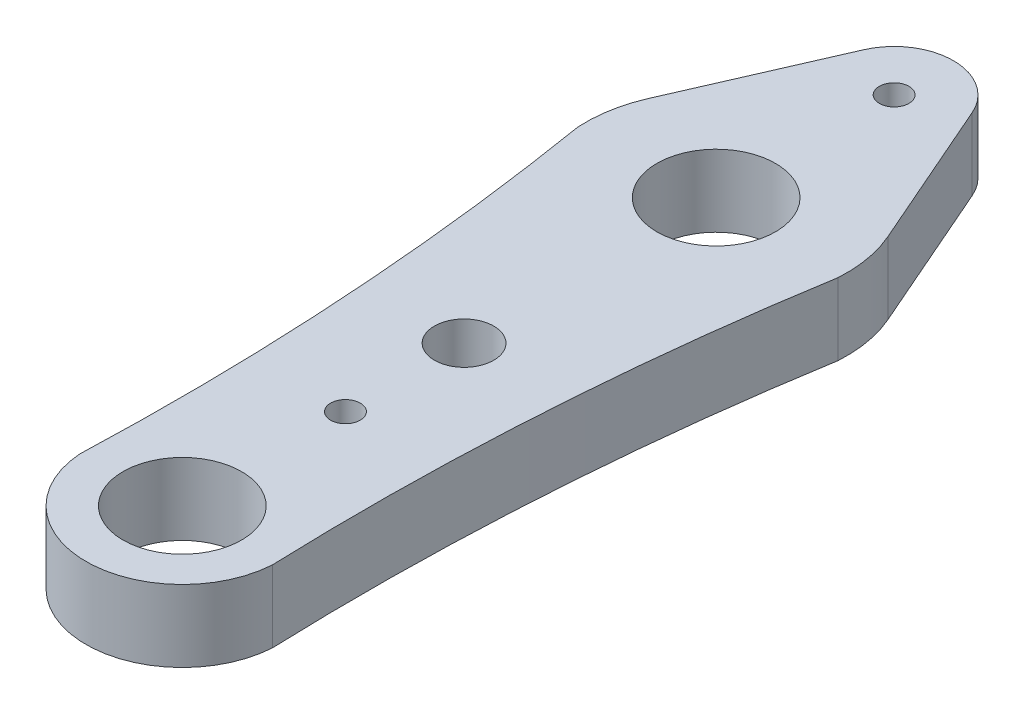
ISO-10303-21;
HEADER;
FILE_DESCRIPTION(('STEP AP214'),'2;1');
FILE_NAME('part.step','',(''),(''),'','','');
FILE_SCHEMA(('AUTOMOTIVE_DESIGN { 1 0 10303 214 1 1 1 1 }'));
ENDSEC;
DATA;
#1=APPLICATION_CONTEXT('core data for automotive mechanical design processes');
#2=APPLICATION_PROTOCOL_DEFINITION('international standard','automotive_design',2000,#1);
#3=PRODUCT_CONTEXT('',#1,'mechanical');
#4=PRODUCT('Part','Part','',(#3));
#5=PRODUCT_RELATED_PRODUCT_CATEGORY('part','',(#4));
#6=PRODUCT_DEFINITION_FORMATION('','',#4);
#7=PRODUCT_DEFINITION_CONTEXT('part definition',#1,'design');
#8=PRODUCT_DEFINITION('design','',#6,#7);
#9=PRODUCT_DEFINITION_SHAPE('','',#8);
#10=(LENGTH_UNIT() NAMED_UNIT(*) SI_UNIT(.MILLI.,.METRE.));
#11=(NAMED_UNIT(*) PLANE_ANGLE_UNIT() SI_UNIT($,.RADIAN.));
#12=(NAMED_UNIT(*) SI_UNIT($,.STERADIAN.) SOLID_ANGLE_UNIT());
#13=UNCERTAINTY_MEASURE_WITH_UNIT(LENGTH_MEASURE(1.E-05),#10,'distance_accuracy_value','');
#14=(GEOMETRIC_REPRESENTATION_CONTEXT(3) GLOBAL_UNCERTAINTY_ASSIGNED_CONTEXT((#13)) GLOBAL_UNIT_ASSIGNED_CONTEXT((#10,
#11,#12)) REPRESENTATION_CONTEXT('',''));
#15=CARTESIAN_POINT('',(0.,0.,0.));
#16=DIRECTION('',(0.,0.,1.));
#17=DIRECTION('',(1.,0.,0.));
#18=AXIS2_PLACEMENT_3D('',#15,#16,#17);
#19=CARTESIAN_POINT('',(14.2976361682622,4.85,-6.24000000000001));
#20=DIRECTION('',(0.916515138991168,0.,-0.4));
#21=DIRECTION('',(-0.4,0.,-0.916515138991168));
#22=AXIS2_PLACEMENT_3D('',#19,#20,#21);
#23=PLANE('',#22);
#24=DIRECTION('',(0.400000000000001,0.,0.916515138991168));
#25=VECTOR('',#24,1.);
#26=CARTESIAN_POINT('',(14.2976361682622,0.,-6.24000000000001));
#27=LINE('',#26,#25);
#28=CARTESIAN_POINT('',(3.66606055596467,0.,-30.6));
#29=VERTEX_POINT('',#28);
#30=CARTESIAN_POINT('',(8.06533322312229,0.,-20.52));
#31=VERTEX_POINT('',#30);
#32=EDGE_CURVE('E164',#29,#31,#27,.T.);
#33=ORIENTED_EDGE('',*,*,#32,.F.);
#34=DIRECTION('',(0.,-1.,0.));
#35=VECTOR('',#34,1.);
#36=CARTESIAN_POINT('',(3.66606055596467,4.85,-30.6));
#37=LINE('',#36,#35);
#38=CARTESIAN_POINT('',(3.66606055596467,4.85,-30.6));
#39=VERTEX_POINT('',#38);
#40=EDGE_CURVE('E11',#39,#29,#37,.T.);
#41=ORIENTED_EDGE('',*,*,#40,.F.);
#42=DIRECTION('',(0.400000000000001,0.,0.916515138991168));
#43=VECTOR('',#42,1.);
#44=CARTESIAN_POINT('',(14.2976361682622,4.85,-6.24000000000001));
#45=LINE('',#44,#43);
#46=CARTESIAN_POINT('',(8.06533322312229,4.85,-20.52));
#47=VERTEX_POINT('',#46);
#48=EDGE_CURVE('E230',#39,#47,#45,.T.);
#49=ORIENTED_EDGE('',*,*,#48,.T.);
#50=DIRECTION('',(0.,-1.,0.));
#51=VECTOR('',#50,1.);
#52=CARTESIAN_POINT('',(8.06533322312229,4.85,-20.52));
#53=LINE('',#52,#51);
#54=EDGE_CURVE('E97',#47,#31,#53,.T.);
#55=ORIENTED_EDGE('',*,*,#54,.T.);
#56=EDGE_LOOP('',(#33,#41,#49,#55));
#57=FACE_BOUND('',#56,.T.);
#58=ADVANCED_FACE('F45',(#57),#23,.T.);
#59=CARTESIAN_POINT('',(0.,4.85,-29.));
#60=DIRECTION('',(0.,-1.,0.));
#61=DIRECTION('',(0.,0.,-1.));
#62=AXIS2_PLACEMENT_3D('',#59,#60,#61);
#63=CYLINDRICAL_SURFACE('',#62,4.);
#64=CARTESIAN_POINT('',(0.,0.,-29.));
#65=DIRECTION('',(0.,1.,0.));
#66=DIRECTION('',(0.,0.,1.));
#67=AXIS2_PLACEMENT_3D('',#64,#65,#66);
#68=CIRCLE('',#67,4.);
#69=CARTESIAN_POINT('',(-3.66606055596467,0.,-30.6));
#70=VERTEX_POINT('',#69);
#71=EDGE_CURVE('E168',#29,#70,#68,.T.);
#72=ORIENTED_EDGE('',*,*,#71,.T.);
#73=DIRECTION('',(0.,-1.,0.));
#74=VECTOR('',#73,1.);
#75=CARTESIAN_POINT('',(-3.66606055596467,4.85,-30.6));
#76=LINE('',#75,#74);
#77=CARTESIAN_POINT('',(-3.66606055596467,4.85,-30.6));
#78=VERTEX_POINT('',#77);
#79=EDGE_CURVE('E55',#78,#70,#76,.T.);
#80=ORIENTED_EDGE('',*,*,#79,.F.);
#81=CARTESIAN_POINT('',(0.,4.85,-29.));
#82=DIRECTION('',(0.,1.,0.));
#83=DIRECTION('',(0.,0.,1.));
#84=AXIS2_PLACEMENT_3D('',#81,#82,#83);
#85=CIRCLE('',#84,4.);
#86=EDGE_CURVE('E226',#39,#78,#85,.T.);
#87=ORIENTED_EDGE('',*,*,#86,.F.);
#88=ORIENTED_EDGE('',*,*,#40,.T.);
#89=EDGE_LOOP('',(#72,#80,#87,#88));
#90=FACE_BOUND('',#89,.T.);
#91=ADVANCED_FACE('F215',(#90),#63,.T.);
#92=CARTESIAN_POINT('',(-14.2976361682622,4.85,-6.24));
#93=DIRECTION('',(-0.916515138991168,0.,-0.4));
#94=DIRECTION('',(-0.4,0.,0.916515138991168));
#95=AXIS2_PLACEMENT_3D('',#92,#93,#94);
#96=PLANE('',#95);
#97=DIRECTION('',(0.4,0.,-0.916515138991168));
#98=VECTOR('',#97,1.);
#99=CARTESIAN_POINT('',(-14.2976361682622,0.,-6.24));
#100=LINE('',#99,#98);
#101=CARTESIAN_POINT('',(-8.06533322312228,0.,-20.52));
#102=VERTEX_POINT('',#101);
#103=EDGE_CURVE('E172',#102,#70,#100,.T.);
#104=ORIENTED_EDGE('',*,*,#103,.F.);
#105=DIRECTION('',(0.,-1.,0.));
#106=VECTOR('',#105,1.);
#107=CARTESIAN_POINT('',(-8.06533322312228,4.85,-20.52));
#108=LINE('',#107,#106);
#109=CARTESIAN_POINT('',(-8.06533322312228,4.85,-20.52));
#110=VERTEX_POINT('',#109);
#111=EDGE_CURVE('E203',#110,#102,#108,.T.);
#112=ORIENTED_EDGE('',*,*,#111,.F.);
#113=DIRECTION('',(0.4,0.,-0.916515138991168));
#114=VECTOR('',#113,1.);
#115=CARTESIAN_POINT('',(-14.2976361682622,4.85,-6.24));
#116=LINE('',#115,#114);
#117=EDGE_CURVE('E212',#110,#78,#116,.T.);
#118=ORIENTED_EDGE('',*,*,#117,.T.);
#119=ORIENTED_EDGE('',*,*,#79,.T.);
#120=EDGE_LOOP('',(#104,#112,#118,#119));
#121=FACE_BOUND('',#120,.T.);
#122=ADVANCED_FACE('F210',(#121),#96,.T.);
#123=CARTESIAN_POINT('',(0.,4.85,-17.));
#124=DIRECTION('',(0.,-1.,0.));
#125=DIRECTION('',(0.,0.,-1.));
#126=AXIS2_PLACEMENT_3D('',#123,#124,#125);
#127=CYLINDRICAL_SURFACE('',#126,8.79999999999994);
#128=CARTESIAN_POINT('',(0.,0.,-17.));
#129=DIRECTION('',(0.,1.,0.));
#130=DIRECTION('',(0.,0.,1.));
#131=AXIS2_PLACEMENT_3D('',#128,#129,#130);
#132=CIRCLE('',#131,8.79999999999994);
#133=CARTESIAN_POINT('',(-8.78202175884568,0.,-16.4377777777778));
#134=VERTEX_POINT('',#133);
#135=EDGE_CURVE('E176',#102,#134,#132,.T.);
#136=ORIENTED_EDGE('',*,*,#135,.T.);
#137=DIRECTION('',(0.,-1.,0.));
#138=VECTOR('',#137,1.);
#139=CARTESIAN_POINT('',(-8.78202175884568,4.85,-16.4377777777778));
#140=LINE('',#139,#138);
#141=CARTESIAN_POINT('',(-8.78202175884568,4.85,-16.4377777777778));
#142=VERTEX_POINT('',#141);
#143=EDGE_CURVE('E199',#142,#134,#140,.T.);
#144=ORIENTED_EDGE('',*,*,#143,.F.);
#145=CARTESIAN_POINT('',(0.,4.85,-17.));
#146=DIRECTION('',(0.,1.,0.));
#147=DIRECTION('',(0.,0.,1.));
#148=AXIS2_PLACEMENT_3D('',#145,#146,#147);
#149=CIRCLE('',#148,8.79999999999994);
#150=EDGE_CURVE('E223',#110,#142,#149,.T.);
#151=ORIENTED_EDGE('',*,*,#150,.F.);
#152=ORIENTED_EDGE('',*,*,#111,.T.);
#153=EDGE_LOOP('',(#136,#144,#151,#152));
#154=FACE_BOUND('',#153,.T.);
#155=ADVANCED_FACE('F221',(#154),#127,.T.);
#156=CARTESIAN_POINT('',(-186.369900957167,4.85,12.9313414096022));
#157=DIRECTION('',(0.,-1.,0.));
#158=DIRECTION('',(0.,0.,-1.));
#159=AXIS2_PLACEMENT_3D('',#156,#157,#158);
#160=CYLINDRICAL_SURFACE('',#159,180.);
#161=CARTESIAN_POINT('',(-186.369900957167,0.,12.9313414096022));
#162=DIRECTION('',(0.,1.,0.));
#163=DIRECTION('',(0.,0.,1.));
#164=AXIS2_PLACEMENT_3D('',#161,#162,#163);
#165=CIRCLE('',#164,180.);
#166=CARTESIAN_POINT('',(-6.48672061733083,0.,19.4152777777413));
#167=VERTEX_POINT('',#166);
#168=EDGE_CURVE('E180',#134,#167,#165,.F.);
#169=ORIENTED_EDGE('',*,*,#168,.T.);
#170=DIRECTION('',(0.,-1.,0.));
#171=VECTOR('',#170,1.);
#172=CARTESIAN_POINT('',(-6.48672061733083,4.85,19.4152777777413));
#173=LINE('',#172,#171);
#174=CARTESIAN_POINT('',(-6.48672061733083,4.85,19.4152777777413));
#175=VERTEX_POINT('',#174);
#176=EDGE_CURVE('E135',#175,#167,#173,.T.);
#177=ORIENTED_EDGE('',*,*,#176,.F.);
#178=CARTESIAN_POINT('',(-186.369900957167,4.85,12.9313414096022));
#179=DIRECTION('',(0.,1.,0.));
#180=DIRECTION('',(0.,0.,1.));
#181=AXIS2_PLACEMENT_3D('',#178,#179,#180);
#182=CIRCLE('',#181,180.);
#183=EDGE_CURVE('E121',#142,#175,#182,.F.);
#184=ORIENTED_EDGE('',*,*,#183,.F.);
#185=ORIENTED_EDGE('',*,*,#143,.T.);
#186=EDGE_LOOP('',(#169,#177,#184,#185));
#187=FACE_BOUND('',#186,.T.);
#188=ADVANCED_FACE('F322',(#187),#160,.F.);
#189=CARTESIAN_POINT('',(0.,4.85,19.));
#190=DIRECTION('',(0.,-1.,0.));
#191=DIRECTION('',(0.,0.,-1.));
#192=AXIS2_PLACEMENT_3D('',#189,#190,#191);
#193=CYLINDRICAL_SURFACE('',#192,6.49999999999929);
#194=CARTESIAN_POINT('',(0.,0.,19.));
#195=DIRECTION('',(0.,1.,0.));
#196=DIRECTION('',(0.,0.,1.));
#197=AXIS2_PLACEMENT_3D('',#194,#195,#196);
#198=CIRCLE('',#197,6.49999999999929);
#199=CARTESIAN_POINT('',(6.48672061732839,0.,19.4152777777797));
#200=VERTEX_POINT('',#199);
#201=EDGE_CURVE('E130',#167,#200,#198,.T.);
#202=ORIENTED_EDGE('',*,*,#201,.T.);
#203=DIRECTION('',(0.,-1.,0.));
#204=VECTOR('',#203,1.);
#205=CARTESIAN_POINT('',(6.48672061732839,4.85,19.4152777777797));
#206=LINE('',#205,#204);
#207=CARTESIAN_POINT('',(6.48672061732839,4.85,19.4152777777797));
#208=VERTEX_POINT('',#207);
#209=EDGE_CURVE('E128',#208,#200,#206,.T.);
#210=ORIENTED_EDGE('',*,*,#209,.F.);
#211=CARTESIAN_POINT('',(0.,4.85,19.));
#212=DIRECTION('',(0.,1.,0.));
#213=DIRECTION('',(0.,0.,1.));
#214=AXIS2_PLACEMENT_3D('',#211,#212,#213);
#215=CIRCLE('',#214,6.49999999999929);
#216=EDGE_CURVE('E115',#175,#208,#215,.T.);
#217=ORIENTED_EDGE('',*,*,#216,.F.);
#218=ORIENTED_EDGE('',*,*,#176,.T.);
#219=EDGE_LOOP('',(#202,#210,#217,#218));
#220=FACE_BOUND('',#219,.T.);
#221=ADVANCED_FACE('F129',(#220),#193,.T.);
#222=CARTESIAN_POINT('',(186.369900957163,4.85,12.9313414096301));
#223=DIRECTION('',(0.,-1.,0.));
#224=DIRECTION('',(0.,0.,-1.));
#225=AXIS2_PLACEMENT_3D('',#222,#223,#224);
#226=CYLINDRICAL_SURFACE('',#225,179.999999999999);
#227=CARTESIAN_POINT('',(186.369900957163,0.,12.9313414096301));
#228=DIRECTION('',(0.,1.,0.));
#229=DIRECTION('',(0.,0.,1.));
#230=AXIS2_PLACEMENT_3D('',#227,#228,#229);
#231=CIRCLE('',#230,179.999999999999);
#232=CARTESIAN_POINT('',(8.7820217588446,0.,-16.4377777777603));
#233=VERTEX_POINT('',#232);
#234=EDGE_CURVE('E186',#233,#200,#231,.T.);
#235=ORIENTED_EDGE('',*,*,#234,.F.);
#236=DIRECTION('',(0.,-1.,0.));
#237=VECTOR('',#236,1.);
#238=CARTESIAN_POINT('',(8.7820217588446,4.85,-16.4377777777603));
#239=LINE('',#238,#237);
#240=CARTESIAN_POINT('',(8.7820217588446,4.85,-16.4377777777603));
#241=VERTEX_POINT('',#240);
#242=EDGE_CURVE('E90',#241,#233,#239,.T.);
#243=ORIENTED_EDGE('',*,*,#242,.F.);
#244=CARTESIAN_POINT('',(186.369900957163,4.85,12.9313414096301));
#245=DIRECTION('',(0.,1.,0.));
#246=DIRECTION('',(0.,0.,1.));
#247=AXIS2_PLACEMENT_3D('',#244,#245,#246);
#248=CIRCLE('',#247,179.999999999999);
#249=EDGE_CURVE('E119',#241,#208,#248,.T.);
#250=ORIENTED_EDGE('',*,*,#249,.T.);
#251=ORIENTED_EDGE('',*,*,#209,.T.);
#252=EDGE_LOOP('',(#235,#243,#250,#251));
#253=FACE_BOUND('',#252,.T.);
#254=ADVANCED_FACE('F137',(#253),#226,.F.);
#255=CARTESIAN_POINT('',(0.,4.85,-29.));
#256=DIRECTION('',(0.,-1.,0.));
#257=DIRECTION('',(0.,0.,-1.));
#258=AXIS2_PLACEMENT_3D('',#255,#256,#257);
#259=CYLINDRICAL_SURFACE('',#258,1.);
#260=CARTESIAN_POINT('',(0.,4.85,-29.));
#261=DIRECTION('',(0.,1.,0.));
#262=DIRECTION('',(0.,0.,1.));
#263=AXIS2_PLACEMENT_3D('',#260,#261,#262);
#264=CIRCLE('',#263,1.);
#265=CARTESIAN_POINT('',(0.,4.85,-28.));
#266=VERTEX_POINT('',#265);
#267=EDGE_CURVE('E236',#266,#266,#264,.T.);
#268=ORIENTED_EDGE('',*,*,#267,.T.);
#269=EDGE_LOOP('',(#268));
#270=FACE_BOUND('',#269,.T.);
#271=CARTESIAN_POINT('',(0.,0.,-29.));
#272=DIRECTION('',(0.,1.,0.));
#273=DIRECTION('',(0.,0.,1.));
#274=AXIS2_PLACEMENT_3D('',#271,#272,#273);
#275=CIRCLE('',#274,1.);
#276=CARTESIAN_POINT('',(0.,0.,-28.));
#277=VERTEX_POINT('',#276);
#278=EDGE_CURVE('E160',#277,#277,#275,.T.);
#279=ORIENTED_EDGE('',*,*,#278,.F.);
#280=EDGE_LOOP('',(#279));
#281=FACE_BOUND('',#280,.T.);
#282=ADVANCED_FACE('F270',(#270,#281),#259,.F.);
#283=CARTESIAN_POINT('',(0.,4.85,19.));
#284=DIRECTION('',(0.,-1.,0.));
#285=DIRECTION('',(0.,0.,-1.));
#286=AXIS2_PLACEMENT_3D('',#283,#284,#285);
#287=CYLINDRICAL_SURFACE('',#286,4.);
#288=CARTESIAN_POINT('',(0.,4.85,19.));
#289=DIRECTION('',(0.,1.,0.));
#290=DIRECTION('',(0.,0.,1.));
#291=AXIS2_PLACEMENT_3D('',#288,#289,#290);
#292=CIRCLE('',#291,4.);
#293=CARTESIAN_POINT('',(0.,4.85,23.));
#294=VERTEX_POINT('',#293);
#295=EDGE_CURVE('E240',#294,#294,#292,.T.);
#296=ORIENTED_EDGE('',*,*,#295,.T.);
#297=EDGE_LOOP('',(#296));
#298=FACE_BOUND('',#297,.T.);
#299=CARTESIAN_POINT('',(0.,0.,19.));
#300=DIRECTION('',(0.,1.,0.));
#301=DIRECTION('',(0.,0.,1.));
#302=AXIS2_PLACEMENT_3D('',#299,#300,#301);
#303=CIRCLE('',#302,4.);
#304=CARTESIAN_POINT('',(0.,0.,23.));
#305=VERTEX_POINT('',#304);
#306=EDGE_CURVE('E156',#305,#305,#303,.T.);
#307=ORIENTED_EDGE('',*,*,#306,.F.);
#308=EDGE_LOOP('',(#307));
#309=FACE_BOUND('',#308,.T.);
#310=ADVANCED_FACE('F273',(#298,#309),#287,.F.);
#311=CARTESIAN_POINT('',(0.,4.85,-17.));
#312=DIRECTION('',(0.,-1.,0.));
#313=DIRECTION('',(0.,0.,-1.));
#314=AXIS2_PLACEMENT_3D('',#311,#312,#313);
#315=CYLINDRICAL_SURFACE('',#314,4.);
#316=CARTESIAN_POINT('',(0.,4.85,-17.));
#317=DIRECTION('',(0.,1.,0.));
#318=DIRECTION('',(0.,0.,1.));
#319=AXIS2_PLACEMENT_3D('',#316,#317,#318);
#320=CIRCLE('',#319,4.);
#321=CARTESIAN_POINT('',(0.,4.85,-13.));
#322=VERTEX_POINT('',#321);
#323=EDGE_CURVE('E244',#322,#322,#320,.T.);
#324=ORIENTED_EDGE('',*,*,#323,.T.);
#325=EDGE_LOOP('',(#324));
#326=FACE_BOUND('',#325,.T.);
#327=CARTESIAN_POINT('',(0.,0.,-17.));
#328=DIRECTION('',(0.,1.,0.));
#329=DIRECTION('',(0.,0.,1.));
#330=AXIS2_PLACEMENT_3D('',#327,#328,#329);
#331=CIRCLE('',#330,4.);
#332=CARTESIAN_POINT('',(0.,0.,-13.));
#333=VERTEX_POINT('',#332);
#334=EDGE_CURVE('E152',#333,#333,#331,.T.);
#335=ORIENTED_EDGE('',*,*,#334,.F.);
#336=EDGE_LOOP('',(#335));
#337=FACE_BOUND('',#336,.T.);
#338=ADVANCED_FACE('F294',(#326,#337),#315,.F.);
#339=CARTESIAN_POINT('',(0.,4.85,0.));
#340=DIRECTION('',(0.,-1.,0.));
#341=DIRECTION('',(0.,0.,-1.));
#342=AXIS2_PLACEMENT_3D('',#339,#340,#341);
#343=CYLINDRICAL_SURFACE('',#342,2.);
#344=CARTESIAN_POINT('',(0.,4.85,0.));
#345=DIRECTION('',(0.,1.,0.));
#346=DIRECTION('',(0.,0.,1.));
#347=AXIS2_PLACEMENT_3D('',#344,#345,#346);
#348=CIRCLE('',#347,2.);
#349=CARTESIAN_POINT('',(0.,4.85,2.));
#350=VERTEX_POINT('',#349);
#351=EDGE_CURVE('E248',#350,#350,#348,.T.);
#352=ORIENTED_EDGE('',*,*,#351,.T.);
#353=EDGE_LOOP('',(#352));
#354=FACE_BOUND('',#353,.T.);
#355=CARTESIAN_POINT('',(0.,0.,0.));
#356=DIRECTION('',(0.,1.,0.));
#357=DIRECTION('',(0.,0.,1.));
#358=AXIS2_PLACEMENT_3D('',#355,#356,#357);
#359=CIRCLE('',#358,2.);
#360=CARTESIAN_POINT('',(0.,0.,2.));
#361=VERTEX_POINT('',#360);
#362=EDGE_CURVE('E148',#361,#361,#359,.T.);
#363=ORIENTED_EDGE('',*,*,#362,.F.);
#364=EDGE_LOOP('',(#363));
#365=FACE_BOUND('',#364,.T.);
#366=ADVANCED_FACE('F297',(#354,#365),#343,.F.);
#367=CARTESIAN_POINT('',(0.,4.85,8.));
#368=DIRECTION('',(0.,-1.,0.));
#369=DIRECTION('',(0.,0.,-1.));
#370=AXIS2_PLACEMENT_3D('',#367,#368,#369);
#371=CYLINDRICAL_SURFACE('',#370,1.);
#372=CARTESIAN_POINT('',(0.,4.85,8.));
#373=DIRECTION('',(0.,1.,0.));
#374=DIRECTION('',(0.,0.,1.));
#375=AXIS2_PLACEMENT_3D('',#372,#373,#374);
#376=CIRCLE('',#375,1.);
#377=CARTESIAN_POINT('',(0.,4.85,9.00000000000001));
#378=VERTEX_POINT('',#377);
#379=EDGE_CURVE('E192',#378,#378,#376,.T.);
#380=ORIENTED_EDGE('',*,*,#379,.T.);
#381=EDGE_LOOP('',(#380));
#382=FACE_BOUND('',#381,.T.);
#383=CARTESIAN_POINT('',(0.,0.,8.));
#384=DIRECTION('',(0.,1.,0.));
#385=DIRECTION('',(0.,0.,1.));
#386=AXIS2_PLACEMENT_3D('',#383,#384,#385);
#387=CIRCLE('',#386,1.);
#388=CARTESIAN_POINT('',(0.,0.,9.00000000000001));
#389=VERTEX_POINT('',#388);
#390=EDGE_CURVE('E144',#389,#389,#387,.T.);
#391=ORIENTED_EDGE('',*,*,#390,.F.);
#392=EDGE_LOOP('',(#391));
#393=FACE_BOUND('',#392,.T.);
#394=ADVANCED_FACE('F47',(#382,#393),#371,.F.);
#395=CARTESIAN_POINT('',(0.,4.85,-17.));
#396=DIRECTION('',(0.,-1.,0.));
#397=DIRECTION('',(0.,0.,-1.));
#398=AXIS2_PLACEMENT_3D('',#395,#396,#397);
#399=CYLINDRICAL_SURFACE('',#398,8.8);
#400=CARTESIAN_POINT('',(0.,0.,-17.));
#401=DIRECTION('',(0.,1.,0.));
#402=DIRECTION('',(0.,0.,1.));
#403=AXIS2_PLACEMENT_3D('',#400,#401,#402);
#404=CIRCLE('',#403,8.8);
#405=EDGE_CURVE('E189',#233,#31,#404,.T.);
#406=ORIENTED_EDGE('',*,*,#405,.T.);
#407=ORIENTED_EDGE('',*,*,#54,.F.);
#408=CARTESIAN_POINT('',(0.,4.85,-17.));
#409=DIRECTION('',(0.,1.,0.));
#410=DIRECTION('',(0.,0.,1.));
#411=AXIS2_PLACEMENT_3D('',#408,#409,#410);
#412=CIRCLE('',#411,8.8);
#413=EDGE_CURVE('E63',#241,#47,#412,.T.);
#414=ORIENTED_EDGE('',*,*,#413,.F.);
#415=ORIENTED_EDGE('',*,*,#242,.T.);
#416=EDGE_LOOP('',(#406,#407,#414,#415));
#417=FACE_BOUND('',#416,.T.);
#418=ADVANCED_FACE('F260',(#417),#399,.T.);
#419=CARTESIAN_POINT('',(0.,4.85,0.));
#420=DIRECTION('',(0.,1.,0.));
#421=DIRECTION('',(0.,0.,1.));
#422=AXIS2_PLACEMENT_3D('',#419,#420,#421);
#423=PLANE('',#422);
#424=ORIENTED_EDGE('',*,*,#379,.F.);
#425=EDGE_LOOP('',(#424));
#426=FACE_BOUND('',#425,.T.);
#427=ORIENTED_EDGE('',*,*,#351,.F.);
#428=EDGE_LOOP('',(#427));
#429=FACE_BOUND('',#428,.T.);
#430=ORIENTED_EDGE('',*,*,#323,.F.);
#431=EDGE_LOOP('',(#430));
#432=FACE_BOUND('',#431,.T.);
#433=ORIENTED_EDGE('',*,*,#295,.F.);
#434=EDGE_LOOP('',(#433));
#435=FACE_BOUND('',#434,.T.);
#436=ORIENTED_EDGE('',*,*,#267,.F.);
#437=EDGE_LOOP('',(#436));
#438=FACE_BOUND('',#437,.T.);
#439=ORIENTED_EDGE('',*,*,#48,.F.);
#440=ORIENTED_EDGE('',*,*,#86,.T.);
#441=ORIENTED_EDGE('',*,*,#117,.F.);
#442=ORIENTED_EDGE('',*,*,#150,.T.);
#443=ORIENTED_EDGE('',*,*,#183,.T.);
#444=ORIENTED_EDGE('',*,*,#216,.T.);
#445=ORIENTED_EDGE('',*,*,#249,.F.);
#446=ORIENTED_EDGE('',*,*,#413,.T.);
#447=EDGE_LOOP('',(#439,#440,#441,#442,#443,#444,#445,#446));
#448=FACE_BOUND('',#447,.T.);
#449=ADVANCED_FACE('F117',(#426,#429,#432,#435,#438,#448),#423,.T.);
#450=CARTESIAN_POINT('',(0.,0.,0.));
#451=DIRECTION('',(0.,1.,0.));
#452=DIRECTION('',(0.,0.,1.));
#453=AXIS2_PLACEMENT_3D('',#450,#451,#452);
#454=PLANE('',#453);
#455=ORIENTED_EDGE('',*,*,#390,.T.);
#456=EDGE_LOOP('',(#455));
#457=FACE_BOUND('',#456,.T.);
#458=ORIENTED_EDGE('',*,*,#362,.T.);
#459=EDGE_LOOP('',(#458));
#460=FACE_BOUND('',#459,.T.);
#461=ORIENTED_EDGE('',*,*,#334,.T.);
#462=EDGE_LOOP('',(#461));
#463=FACE_BOUND('',#462,.T.);
#464=ORIENTED_EDGE('',*,*,#306,.T.);
#465=EDGE_LOOP('',(#464));
#466=FACE_BOUND('',#465,.T.);
#467=ORIENTED_EDGE('',*,*,#278,.T.);
#468=EDGE_LOOP('',(#467));
#469=FACE_BOUND('',#468,.T.);
#470=ORIENTED_EDGE('',*,*,#32,.T.);
#471=ORIENTED_EDGE('',*,*,#405,.F.);
#472=ORIENTED_EDGE('',*,*,#234,.T.);
#473=ORIENTED_EDGE('',*,*,#201,.F.);
#474=ORIENTED_EDGE('',*,*,#168,.F.);
#475=ORIENTED_EDGE('',*,*,#135,.F.);
#476=ORIENTED_EDGE('',*,*,#103,.T.);
#477=ORIENTED_EDGE('',*,*,#71,.F.);
#478=EDGE_LOOP('',(#470,#471,#472,#473,#474,#475,#476,#477));
#479=FACE_BOUND('',#478,.T.);
#480=ADVANCED_FACE('F218',(#457,#460,#463,#466,#469,#479),#454,.F.);
#481=CLOSED_SHELL('',(#58,#91,#122,#155,#188,#221,#254,#282,#310,#338,#366,#394,#418,#449,#480));
#482=MANIFOLD_SOLID_BREP('B2',#481);
#483=ADVANCED_BREP_SHAPE_REPRESENTATION('',(#18,#482),#14);
#484=SHAPE_DEFINITION_REPRESENTATION(#9,#483);
ENDSEC;
END-ISO-10303-21;
